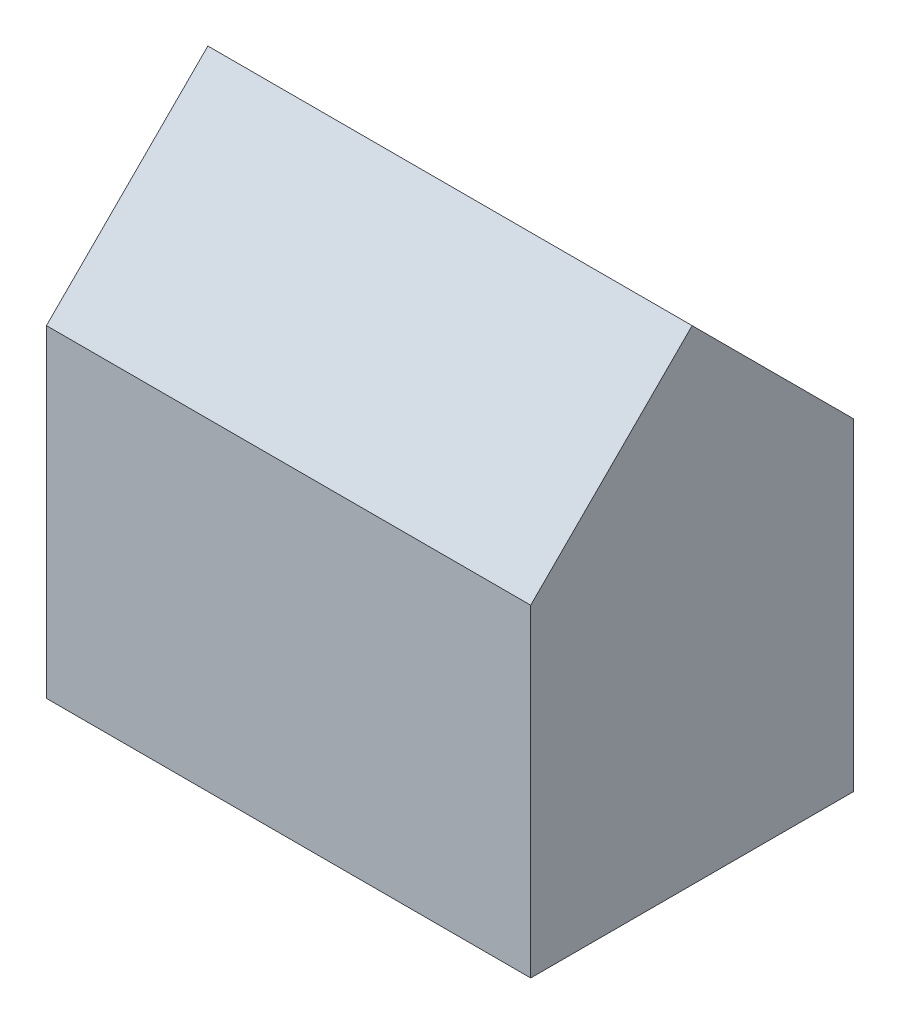
ISO-10303-21;
HEADER;
FILE_DESCRIPTION(('STEP AP214'),'2;1');
FILE_NAME('part.step','',(''),(''),'','','');
FILE_SCHEMA(('AUTOMOTIVE_DESIGN { 1 0 10303 214 1 1 1 1 }'));
ENDSEC;
DATA;
#1=APPLICATION_CONTEXT('core data for automotive mechanical design processes');
#2=APPLICATION_PROTOCOL_DEFINITION('international standard','automotive_design',2000,#1);
#3=PRODUCT_CONTEXT('',#1,'mechanical');
#4=PRODUCT('Part','Part','',(#3));
#5=PRODUCT_RELATED_PRODUCT_CATEGORY('part','',(#4));
#6=PRODUCT_DEFINITION_FORMATION('','',#4);
#7=PRODUCT_DEFINITION_CONTEXT('part definition',#1,'design');
#8=PRODUCT_DEFINITION('design','',#6,#7);
#9=PRODUCT_DEFINITION_SHAPE('','',#8);
#10=(LENGTH_UNIT() NAMED_UNIT(*) SI_UNIT(.MILLI.,.METRE.));
#11=(NAMED_UNIT(*) PLANE_ANGLE_UNIT() SI_UNIT($,.RADIAN.));
#12=(NAMED_UNIT(*) SI_UNIT($,.STERADIAN.) SOLID_ANGLE_UNIT());
#13=UNCERTAINTY_MEASURE_WITH_UNIT(LENGTH_MEASURE(1.E-05),#10,'distance_accuracy_value','');
#14=(GEOMETRIC_REPRESENTATION_CONTEXT(3) GLOBAL_UNCERTAINTY_ASSIGNED_CONTEXT((#13)) GLOBAL_UNIT_ASSIGNED_CONTEXT((#10,
#11,#12)) REPRESENTATION_CONTEXT('',''));
#15=CARTESIAN_POINT('',(0.,0.,0.));
#16=DIRECTION('',(0.,0.,1.));
#17=DIRECTION('',(1.,0.,0.));
#18=AXIS2_PLACEMENT_3D('',#15,#16,#17);
#19=CARTESIAN_POINT('',(0.,0.,0.));
#20=DIRECTION('',(0.,-1.,0.));
#21=DIRECTION('',(0.,0.,-1.));
#22=AXIS2_PLACEMENT_3D('',#19,#20,#21);
#23=PLANE('',#22);
#24=DIRECTION('',(0.,0.,1.));
#25=VECTOR('',#24,1.);
#26=CARTESIAN_POINT('',(0.,0.,0.));
#27=LINE('',#26,#25);
#28=CARTESIAN_POINT('',(0.,0.,-10.));
#29=VERTEX_POINT('',#28);
#30=CARTESIAN_POINT('',(0.,0.,0.));
#31=VERTEX_POINT('',#30);
#32=EDGE_CURVE('E170',#29,#31,#27,.T.);
#33=ORIENTED_EDGE('',*,*,#32,.F.);
#34=DIRECTION('',(-1.,0.,0.));
#35=VECTOR('',#34,1.);
#36=CARTESIAN_POINT('',(0.,0.,-10.));
#37=LINE('',#36,#35);
#38=CARTESIAN_POINT('',(15.,0.,-10.));
#39=VERTEX_POINT('',#38);
#40=EDGE_CURVE('E77',#39,#29,#37,.T.);
#41=ORIENTED_EDGE('',*,*,#40,.F.);
#42=DIRECTION('',(0.,0.,-1.));
#43=VECTOR('',#42,1.);
#44=CARTESIAN_POINT('',(15.,0.,0.));
#45=LINE('',#44,#43);
#46=CARTESIAN_POINT('',(15.,0.,0.));
#47=VERTEX_POINT('',#46);
#48=EDGE_CURVE('E175',#47,#39,#45,.T.);
#49=ORIENTED_EDGE('',*,*,#48,.F.);
#50=DIRECTION('',(1.,0.,0.));
#51=VECTOR('',#50,1.);
#52=CARTESIAN_POINT('',(0.,0.,0.));
#53=LINE('',#52,#51);
#54=EDGE_CURVE('E173',#31,#47,#53,.T.);
#55=ORIENTED_EDGE('',*,*,#54,.F.);
#56=EDGE_LOOP('',(#33,#41,#49,#55));
#57=FACE_BOUND('',#56,.T.);
#58=DIRECTION('',(-1.,0.,0.));
#59=VECTOR('',#58,1.);
#60=CARTESIAN_POINT('',(2.,0.,-8.));
#61=LINE('',#60,#59);
#62=CARTESIAN_POINT('',(13.,0.,-8.));
#63=VERTEX_POINT('',#62);
#64=CARTESIAN_POINT('',(2.,0.,-8.));
#65=VERTEX_POINT('',#64);
#66=EDGE_CURVE('E144',#63,#65,#61,.T.);
#67=ORIENTED_EDGE('',*,*,#66,.T.);
#68=DIRECTION('',(0.,0.,1.));
#69=VECTOR('',#68,1.);
#70=CARTESIAN_POINT('',(2.,0.,-2.));
#71=LINE('',#70,#69);
#72=CARTESIAN_POINT('',(2.,0.,-2.));
#73=VERTEX_POINT('',#72);
#74=EDGE_CURVE('E48',#65,#73,#71,.T.);
#75=ORIENTED_EDGE('',*,*,#74,.T.);
#76=DIRECTION('',(1.,0.,0.));
#77=VECTOR('',#76,1.);
#78=CARTESIAN_POINT('',(2.,0.,-2.));
#79=LINE('',#78,#77);
#80=CARTESIAN_POINT('',(13.,0.,-2.));
#81=VERTEX_POINT('',#80);
#82=EDGE_CURVE('E155',#73,#81,#79,.T.);
#83=ORIENTED_EDGE('',*,*,#82,.T.);
#84=DIRECTION('',(0.,0.,-1.));
#85=VECTOR('',#84,1.);
#86=CARTESIAN_POINT('',(13.,0.,-2.));
#87=LINE('',#86,#85);
#88=EDGE_CURVE('E158',#81,#63,#87,.T.);
#89=ORIENTED_EDGE('',*,*,#88,.T.);
#90=EDGE_LOOP('',(#67,#75,#83,#89));
#91=FACE_BOUND('',#90,.T.);
#92=ADVANCED_FACE('F33',(#57,#91),#23,.T.);
#93=CARTESIAN_POINT('',(0.,10.,0.));
#94=DIRECTION('',(1.,0.,0.));
#95=DIRECTION('',(0.,0.,-1.));
#96=AXIS2_PLACEMENT_3D('',#93,#94,#95);
#97=PLANE('',#96);
#98=ORIENTED_EDGE('',*,*,#32,.T.);
#99=DIRECTION('',(0.,-1.,0.));
#100=VECTOR('',#99,1.);
#101=CARTESIAN_POINT('',(0.,10.,0.));
#102=LINE('',#101,#100);
#103=CARTESIAN_POINT('',(0.,10.,0.));
#104=VERTEX_POINT('',#103);
#105=EDGE_CURVE('E11',#104,#31,#102,.T.);
#106=ORIENTED_EDGE('',*,*,#105,.F.);
#107=DIRECTION('',(0.,-0.707106781186549,0.707106781186546));
#108=VECTOR('',#107,1.);
#109=CARTESIAN_POINT('',(0.,10.,0.));
#110=LINE('',#109,#108);
#111=CARTESIAN_POINT('',(0.,15.,-5.));
#112=VERTEX_POINT('',#111);
#113=EDGE_CURVE('E130',#112,#104,#110,.T.);
#114=ORIENTED_EDGE('',*,*,#113,.F.);
#115=DIRECTION('',(0.,0.707106781186549,0.707106781186546));
#116=VECTOR('',#115,1.);
#117=CARTESIAN_POINT('',(0.,15.,-5.));
#118=LINE('',#117,#116);
#119=CARTESIAN_POINT('',(0.,10.,-10.));
#120=VERTEX_POINT('',#119);
#121=EDGE_CURVE('E125',#120,#112,#118,.T.);
#122=ORIENTED_EDGE('',*,*,#121,.F.);
#123=DIRECTION('',(0.,-1.,0.));
#124=VECTOR('',#123,1.);
#125=CARTESIAN_POINT('',(0.,10.,-10.));
#126=LINE('',#125,#124);
#127=EDGE_CURVE('E112',#120,#29,#126,.T.);
#128=ORIENTED_EDGE('',*,*,#127,.T.);
#129=EDGE_LOOP('',(#98,#106,#114,#122,#128));
#130=FACE_BOUND('',#129,.T.);
#131=ADVANCED_FACE('F35',(#130),#97,.F.);
#132=CARTESIAN_POINT('',(0.,10.,0.));
#133=DIRECTION('',(0.,0.,-1.));
#134=DIRECTION('',(-1.,0.,0.));
#135=AXIS2_PLACEMENT_3D('',#132,#133,#134);
#136=PLANE('',#135);
#137=ORIENTED_EDGE('',*,*,#54,.T.);
#138=DIRECTION('',(0.,-1.,0.));
#139=VECTOR('',#138,1.);
#140=CARTESIAN_POINT('',(15.,10.,0.));
#141=LINE('',#140,#139);
#142=CARTESIAN_POINT('',(15.,10.,0.));
#143=VERTEX_POINT('',#142);
#144=EDGE_CURVE('E41',#143,#47,#141,.T.);
#145=ORIENTED_EDGE('',*,*,#144,.F.);
#146=DIRECTION('',(1.,0.,0.));
#147=VECTOR('',#146,1.);
#148=CARTESIAN_POINT('',(0.,10.,0.));
#149=LINE('',#148,#147);
#150=EDGE_CURVE('E82',#104,#143,#149,.T.);
#151=ORIENTED_EDGE('',*,*,#150,.F.);
#152=ORIENTED_EDGE('',*,*,#105,.T.);
#153=EDGE_LOOP('',(#137,#145,#151,#152));
#154=FACE_BOUND('',#153,.T.);
#155=ADVANCED_FACE('F202',(#154),#136,.F.);
#156=CARTESIAN_POINT('',(15.,10.,0.));
#157=DIRECTION('',(-1.,0.,0.));
#158=DIRECTION('',(0.,0.,1.));
#159=AXIS2_PLACEMENT_3D('',#156,#157,#158);
#160=PLANE('',#159);
#161=ORIENTED_EDGE('',*,*,#48,.T.);
#162=DIRECTION('',(0.,-1.,0.));
#163=VECTOR('',#162,1.);
#164=CARTESIAN_POINT('',(15.,10.,-10.));
#165=LINE('',#164,#163);
#166=CARTESIAN_POINT('',(15.,10.,-10.));
#167=VERTEX_POINT('',#166);
#168=EDGE_CURVE('E57',#167,#39,#165,.T.);
#169=ORIENTED_EDGE('',*,*,#168,.F.);
#170=DIRECTION('',(0.,0.707106781186549,0.707106781186546));
#171=VECTOR('',#170,1.);
#172=CARTESIAN_POINT('',(15.,15.,-5.));
#173=LINE('',#172,#171);
#174=CARTESIAN_POINT('',(15.,15.,-5.));
#175=VERTEX_POINT('',#174);
#176=EDGE_CURVE('E127',#167,#175,#173,.T.);
#177=ORIENTED_EDGE('',*,*,#176,.T.);
#178=DIRECTION('',(0.,-0.707106781186549,0.707106781186546));
#179=VECTOR('',#178,1.);
#180=CARTESIAN_POINT('',(15.,10.,0.));
#181=LINE('',#180,#179);
#182=EDGE_CURVE('E131',#175,#143,#181,.T.);
#183=ORIENTED_EDGE('',*,*,#182,.T.);
#184=ORIENTED_EDGE('',*,*,#144,.T.);
#185=EDGE_LOOP('',(#161,#169,#177,#183,#184));
#186=FACE_BOUND('',#185,.T.);
#187=ADVANCED_FACE('F180',(#186),#160,.F.);
#188=CARTESIAN_POINT('',(0.,10.,-10.));
#189=DIRECTION('',(0.,0.,1.));
#190=DIRECTION('',(1.,0.,0.));
#191=AXIS2_PLACEMENT_3D('',#188,#189,#190);
#192=PLANE('',#191);
#193=ORIENTED_EDGE('',*,*,#40,.T.);
#194=ORIENTED_EDGE('',*,*,#127,.F.);
#195=DIRECTION('',(-1.,0.,0.));
#196=VECTOR('',#195,1.);
#197=CARTESIAN_POINT('',(0.,10.,-10.));
#198=LINE('',#197,#196);
#199=EDGE_CURVE('E115',#167,#120,#198,.T.);
#200=ORIENTED_EDGE('',*,*,#199,.F.);
#201=ORIENTED_EDGE('',*,*,#168,.T.);
#202=EDGE_LOOP('',(#193,#194,#200,#201));
#203=FACE_BOUND('',#202,.T.);
#204=ADVANCED_FACE('F114',(#203),#192,.F.);
#205=CARTESIAN_POINT('',(2.,10.,-2.));
#206=DIRECTION('',(1.,0.,0.));
#207=DIRECTION('',(0.,0.,-1.));
#208=AXIS2_PLACEMENT_3D('',#205,#206,#207);
#209=PLANE('',#208);
#210=ORIENTED_EDGE('',*,*,#74,.F.);
#211=DIRECTION('',(0.,-1.,0.));
#212=VECTOR('',#211,1.);
#213=CARTESIAN_POINT('',(2.,10.,-8.));
#214=LINE('',#213,#212);
#215=CARTESIAN_POINT('',(2.,10.,-8.));
#216=VERTEX_POINT('',#215);
#217=EDGE_CURVE('E153',#216,#65,#214,.T.);
#218=ORIENTED_EDGE('',*,*,#217,.F.);
#219=DIRECTION('',(0.,0.,1.));
#220=VECTOR('',#219,1.);
#221=CARTESIAN_POINT('',(2.,10.,-2.));
#222=LINE('',#221,#220);
#223=CARTESIAN_POINT('',(2.,10.,-2.));
#224=VERTEX_POINT('',#223);
#225=EDGE_CURVE('E140',#216,#224,#222,.T.);
#226=ORIENTED_EDGE('',*,*,#225,.T.);
#227=DIRECTION('',(0.,-1.,0.));
#228=VECTOR('',#227,1.);
#229=CARTESIAN_POINT('',(2.,10.,-2.));
#230=LINE('',#229,#228);
#231=EDGE_CURVE('E168',#224,#73,#230,.T.);
#232=ORIENTED_EDGE('',*,*,#231,.T.);
#233=EDGE_LOOP('',(#210,#218,#226,#232));
#234=FACE_BOUND('',#233,.T.);
#235=ADVANCED_FACE('F205',(#234),#209,.T.);
#236=CARTESIAN_POINT('',(2.,10.,-2.));
#237=DIRECTION('',(0.,0.,-1.));
#238=DIRECTION('',(-1.,0.,0.));
#239=AXIS2_PLACEMENT_3D('',#236,#237,#238);
#240=PLANE('',#239);
#241=ORIENTED_EDGE('',*,*,#82,.F.);
#242=ORIENTED_EDGE('',*,*,#231,.F.);
#243=DIRECTION('',(1.,0.,0.));
#244=VECTOR('',#243,1.);
#245=CARTESIAN_POINT('',(2.,10.,-2.));
#246=LINE('',#245,#244);
#247=CARTESIAN_POINT('',(13.,10.,-2.));
#248=VERTEX_POINT('',#247);
#249=EDGE_CURVE('E143',#224,#248,#246,.T.);
#250=ORIENTED_EDGE('',*,*,#249,.T.);
#251=DIRECTION('',(0.,-1.,0.));
#252=VECTOR('',#251,1.);
#253=CARTESIAN_POINT('',(13.,10.,-2.));
#254=LINE('',#253,#252);
#255=EDGE_CURVE('E166',#248,#81,#254,.T.);
#256=ORIENTED_EDGE('',*,*,#255,.T.);
#257=EDGE_LOOP('',(#241,#242,#250,#256));
#258=FACE_BOUND('',#257,.T.);
#259=ADVANCED_FACE('F229',(#258),#240,.T.);
#260=CARTESIAN_POINT('',(13.,10.,-2.));
#261=DIRECTION('',(-1.,0.,0.));
#262=DIRECTION('',(0.,0.,1.));
#263=AXIS2_PLACEMENT_3D('',#260,#261,#262);
#264=PLANE('',#263);
#265=ORIENTED_EDGE('',*,*,#88,.F.);
#266=ORIENTED_EDGE('',*,*,#255,.F.);
#267=DIRECTION('',(0.,0.,-1.));
#268=VECTOR('',#267,1.);
#269=CARTESIAN_POINT('',(13.,10.,-2.));
#270=LINE('',#269,#268);
#271=CARTESIAN_POINT('',(13.,10.,-8.));
#272=VERTEX_POINT('',#271);
#273=EDGE_CURVE('E147',#248,#272,#270,.T.);
#274=ORIENTED_EDGE('',*,*,#273,.T.);
#275=DIRECTION('',(0.,-1.,0.));
#276=VECTOR('',#275,1.);
#277=CARTESIAN_POINT('',(13.,10.,-8.));
#278=LINE('',#277,#276);
#279=EDGE_CURVE('E164',#272,#63,#278,.T.);
#280=ORIENTED_EDGE('',*,*,#279,.T.);
#281=EDGE_LOOP('',(#265,#266,#274,#280));
#282=FACE_BOUND('',#281,.T.);
#283=ADVANCED_FACE('F235',(#282),#264,.T.);
#284=CARTESIAN_POINT('',(2.,10.,-8.));
#285=DIRECTION('',(0.,0.,1.));
#286=DIRECTION('',(1.,0.,0.));
#287=AXIS2_PLACEMENT_3D('',#284,#285,#286);
#288=PLANE('',#287);
#289=ORIENTED_EDGE('',*,*,#66,.F.);
#290=ORIENTED_EDGE('',*,*,#279,.F.);
#291=DIRECTION('',(-1.,0.,0.));
#292=VECTOR('',#291,1.);
#293=CARTESIAN_POINT('',(2.,10.,-8.));
#294=LINE('',#293,#292);
#295=EDGE_CURVE('E150',#272,#216,#294,.T.);
#296=ORIENTED_EDGE('',*,*,#295,.T.);
#297=ORIENTED_EDGE('',*,*,#217,.T.);
#298=EDGE_LOOP('',(#289,#290,#296,#297));
#299=FACE_BOUND('',#298,.T.);
#300=ADVANCED_FACE('F194',(#299),#288,.T.);
#301=CARTESIAN_POINT('',(0.,10.,-10.));
#302=DIRECTION('',(0.,-1.,0.));
#303=DIRECTION('',(0.,0.,-1.));
#304=AXIS2_PLACEMENT_3D('',#301,#302,#303);
#305=PLANE('',#304);
#306=ORIENTED_EDGE('',*,*,#249,.F.);
#307=ORIENTED_EDGE('',*,*,#225,.F.);
#308=ORIENTED_EDGE('',*,*,#295,.F.);
#309=ORIENTED_EDGE('',*,*,#273,.F.);
#310=EDGE_LOOP('',(#306,#307,#308,#309));
#311=FACE_BOUND('',#310,.T.);
#312=ADVANCED_FACE('F187',(#311),#305,.T.);
#313=CARTESIAN_POINT('',(0.,10.,0.));
#314=DIRECTION('',(0.,0.707106781186546,0.707106781186549));
#315=DIRECTION('',(0.,-0.707106781186549,0.707106781186546));
#316=AXIS2_PLACEMENT_3D('',#313,#314,#315);
#317=PLANE('',#316);
#318=ORIENTED_EDGE('',*,*,#182,.F.);
#319=DIRECTION('',(1.,0.,0.));
#320=VECTOR('',#319,1.);
#321=CARTESIAN_POINT('',(0.,15.,-5.));
#322=LINE('',#321,#320);
#323=EDGE_CURVE('E133',#112,#175,#322,.T.);
#324=ORIENTED_EDGE('',*,*,#323,.F.);
#325=ORIENTED_EDGE('',*,*,#113,.T.);
#326=ORIENTED_EDGE('',*,*,#150,.T.);
#327=EDGE_LOOP('',(#318,#324,#325,#326));
#328=FACE_BOUND('',#327,.T.);
#329=ADVANCED_FACE('F185',(#328),#317,.T.);
#330=CARTESIAN_POINT('',(0.,15.,-5.));
#331=DIRECTION('',(0.,0.707106781186546,-0.707106781186549));
#332=DIRECTION('',(0.,0.707106781186549,0.707106781186546));
#333=AXIS2_PLACEMENT_3D('',#330,#331,#332);
#334=PLANE('',#333);
#335=ORIENTED_EDGE('',*,*,#176,.F.);
#336=ORIENTED_EDGE('',*,*,#199,.T.);
#337=ORIENTED_EDGE('',*,*,#121,.T.);
#338=ORIENTED_EDGE('',*,*,#323,.T.);
#339=EDGE_LOOP('',(#335,#336,#337,#338));
#340=FACE_BOUND('',#339,.T.);
#341=ADVANCED_FACE('F124',(#340),#334,.T.);
#342=CLOSED_SHELL('',(#92,#131,#155,#187,#204,#235,#259,#283,#300,#312,#329,#341));
#343=MANIFOLD_SOLID_BREP('B2',#342);
#344=ADVANCED_BREP_SHAPE_REPRESENTATION('',(#18,#343),#14);
#345=SHAPE_DEFINITION_REPRESENTATION(#9,#344);
ENDSEC;
END-ISO-10303-21;
